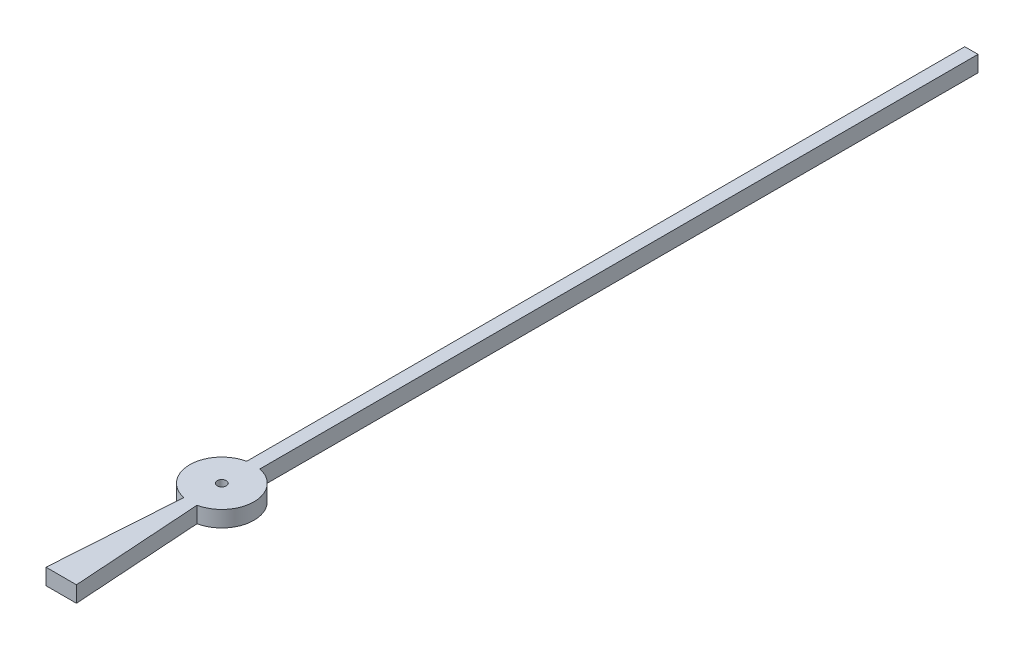
ISO-10303-21;
HEADER;
FILE_DESCRIPTION(('STEP AP214'),'2;1');
FILE_NAME('part.step','',(''),(''),'','','');
FILE_SCHEMA(('AUTOMOTIVE_DESIGN { 1 0 10303 214 1 1 1 1 }'));
ENDSEC;
DATA;
#1=APPLICATION_CONTEXT('core data for automotive mechanical design processes');
#2=APPLICATION_PROTOCOL_DEFINITION('international standard','automotive_design',2000,#1);
#3=PRODUCT_CONTEXT('',#1,'mechanical');
#4=PRODUCT('Part','Part','',(#3));
#5=PRODUCT_RELATED_PRODUCT_CATEGORY('part','',(#4));
#6=PRODUCT_DEFINITION_FORMATION('','',#4);
#7=PRODUCT_DEFINITION_CONTEXT('part definition',#1,'design');
#8=PRODUCT_DEFINITION('design','',#6,#7);
#9=PRODUCT_DEFINITION_SHAPE('','',#8);
#10=(LENGTH_UNIT() NAMED_UNIT(*) SI_UNIT(.MILLI.,.METRE.));
#11=(NAMED_UNIT(*) PLANE_ANGLE_UNIT() SI_UNIT($,.RADIAN.));
#12=(NAMED_UNIT(*) SI_UNIT($,.STERADIAN.) SOLID_ANGLE_UNIT());
#13=UNCERTAINTY_MEASURE_WITH_UNIT(LENGTH_MEASURE(1.E-05),#10,'distance_accuracy_value','');
#14=(GEOMETRIC_REPRESENTATION_CONTEXT(3) GLOBAL_UNCERTAINTY_ASSIGNED_CONTEXT((#13)) GLOBAL_UNIT_ASSIGNED_CONTEXT((#10,
#11,#12)) REPRESENTATION_CONTEXT('',''));
#15=CARTESIAN_POINT('',(0.,0.,0.));
#16=DIRECTION('',(0.,0.,1.));
#17=DIRECTION('',(1.,0.,0.));
#18=AXIS2_PLACEMENT_3D('',#15,#16,#17);
#19=CARTESIAN_POINT('',(0.,0.3,0.));
#20=DIRECTION('',(0.,-1.,0.));
#21=DIRECTION('',(0.,0.,-1.));
#22=AXIS2_PLACEMENT_3D('',#19,#20,#21);
#23=CYLINDRICAL_SURFACE('',#22,0.6);
#24=CARTESIAN_POINT('',(0.,0.,0.));
#25=DIRECTION('',(0.,1.,0.));
#26=DIRECTION('',(0.,0.,-1.));
#27=AXIS2_PLACEMENT_3D('',#24,#25,#26);
#28=CIRCLE('',#27,0.6);
#29=CARTESIAN_POINT('',(0.123615756232359,0.,0.587127877732868));
#30=VERTEX_POINT('',#29);
#31=CARTESIAN_POINT('',(0.123615756232359,0.,-0.587127877732868));
#32=VERTEX_POINT('',#31);
#33=EDGE_CURVE('E129',#30,#32,#28,.T.);
#34=ORIENTED_EDGE('',*,*,#33,.T.);
#35=DIRECTION('',(0.,-1.,0.));
#36=VECTOR('',#35,1.);
#37=CARTESIAN_POINT('',(0.123615756232359,0.3,-0.587127877732868));
#38=LINE('',#37,#36);
#39=CARTESIAN_POINT('',(0.123615756232359,0.3,-0.587127877732868));
#40=VERTEX_POINT('',#39);
#41=EDGE_CURVE('E11',#40,#32,#38,.T.);
#42=ORIENTED_EDGE('',*,*,#41,.F.);
#43=CARTESIAN_POINT('',(0.,0.3,0.));
#44=DIRECTION('',(0.,1.,0.));
#45=DIRECTION('',(0.,0.,-1.));
#46=AXIS2_PLACEMENT_3D('',#43,#44,#45);
#47=CIRCLE('',#46,0.6);
#48=CARTESIAN_POINT('',(0.123615756232359,0.3,0.587127877732868));
#49=VERTEX_POINT('',#48);
#50=EDGE_CURVE('E144',#49,#40,#47,.T.);
#51=ORIENTED_EDGE('',*,*,#50,.F.);
#52=DIRECTION('',(0.,-1.,0.));
#53=VECTOR('',#52,1.);
#54=CARTESIAN_POINT('',(0.123615756232359,0.3,0.587127877732868));
#55=LINE('',#54,#53);
#56=EDGE_CURVE('E125',#49,#30,#55,.T.);
#57=ORIENTED_EDGE('',*,*,#56,.T.);
#58=EDGE_LOOP('',(#34,#42,#51,#57));
#59=FACE_BOUND('',#58,.T.);
#60=ADVANCED_FACE('F33',(#59),#23,.T.);
#61=CARTESIAN_POINT('',(0.123615756232359,0.3,-14.));
#62=DIRECTION('',(-1.,0.,0.));
#63=DIRECTION('',(0.,0.,1.));
#64=AXIS2_PLACEMENT_3D('',#61,#62,#63);
#65=PLANE('',#64);
#66=DIRECTION('',(0.,0.,-1.));
#67=VECTOR('',#66,1.);
#68=CARTESIAN_POINT('',(0.123615756232359,0.,-14.));
#69=LINE('',#68,#67);
#70=CARTESIAN_POINT('',(0.123615756232359,0.,-14.));
#71=VERTEX_POINT('',#70);
#72=EDGE_CURVE('E132',#32,#71,#69,.T.);
#73=ORIENTED_EDGE('',*,*,#72,.T.);
#74=DIRECTION('',(0.,-1.,0.));
#75=VECTOR('',#74,1.);
#76=CARTESIAN_POINT('',(0.123615756232359,0.3,-14.));
#77=LINE('',#76,#75);
#78=CARTESIAN_POINT('',(0.123615756232359,0.3,-14.));
#79=VERTEX_POINT('',#78);
#80=EDGE_CURVE('E41',#79,#71,#77,.T.);
#81=ORIENTED_EDGE('',*,*,#80,.F.);
#82=DIRECTION('',(0.,0.,-1.));
#83=VECTOR('',#82,1.);
#84=CARTESIAN_POINT('',(0.123615756232359,0.3,-14.));
#85=LINE('',#84,#83);
#86=EDGE_CURVE('E92',#40,#79,#85,.T.);
#87=ORIENTED_EDGE('',*,*,#86,.F.);
#88=ORIENTED_EDGE('',*,*,#41,.T.);
#89=EDGE_LOOP('',(#73,#81,#87,#88));
#90=FACE_BOUND('',#89,.T.);
#91=ADVANCED_FACE('F200',(#90),#65,.F.);
#92=CARTESIAN_POINT('',(-0.123615756232363,0.3,-14.));
#93=DIRECTION('',(0.,0.,1.));
#94=DIRECTION('',(1.,0.,0.));
#95=AXIS2_PLACEMENT_3D('',#92,#93,#94);
#96=PLANE('',#95);
#97=DIRECTION('',(-1.,0.,0.));
#98=VECTOR('',#97,1.);
#99=CARTESIAN_POINT('',(-0.123615756232363,0.,-14.));
#100=LINE('',#99,#98);
#101=CARTESIAN_POINT('',(-0.123615756232363,0.,-14.));
#102=VERTEX_POINT('',#101);
#103=EDGE_CURVE('E135',#71,#102,#100,.T.);
#104=ORIENTED_EDGE('',*,*,#103,.T.);
#105=DIRECTION('',(0.,-1.,0.));
#106=VECTOR('',#105,1.);
#107=CARTESIAN_POINT('',(-0.123615756232363,0.3,-14.));
#108=LINE('',#107,#106);
#109=CARTESIAN_POINT('',(-0.123615756232363,0.3,-14.));
#110=VERTEX_POINT('',#109);
#111=EDGE_CURVE('E151',#110,#102,#108,.T.);
#112=ORIENTED_EDGE('',*,*,#111,.F.);
#113=DIRECTION('',(-1.,0.,0.));
#114=VECTOR('',#113,1.);
#115=CARTESIAN_POINT('',(-0.123615756232363,0.3,-14.));
#116=LINE('',#115,#114);
#117=EDGE_CURVE('E159',#79,#110,#116,.T.);
#118=ORIENTED_EDGE('',*,*,#117,.F.);
#119=ORIENTED_EDGE('',*,*,#80,.T.);
#120=EDGE_LOOP('',(#104,#112,#118,#119));
#121=FACE_BOUND('',#120,.T.);
#122=ADVANCED_FACE('F157',(#121),#96,.F.);
#123=CARTESIAN_POINT('',(-0.123615756232363,0.3,-14.));
#124=DIRECTION('',(1.,0.,0.));
#125=DIRECTION('',(0.,0.,-1.));
#126=AXIS2_PLACEMENT_3D('',#123,#124,#125);
#127=PLANE('',#126);
#128=DIRECTION('',(0.,0.,1.));
#129=VECTOR('',#128,1.);
#130=CARTESIAN_POINT('',(-0.123615756232363,0.,-14.));
#131=LINE('',#130,#129);
#132=CARTESIAN_POINT('',(-0.123615756232359,0.,-0.587127877732868));
#133=VERTEX_POINT('',#132);
#134=EDGE_CURVE('E137',#102,#133,#131,.T.);
#135=ORIENTED_EDGE('',*,*,#134,.T.);
#136=DIRECTION('',(0.,-1.,0.));
#137=VECTOR('',#136,1.);
#138=CARTESIAN_POINT('',(-0.123615756232359,0.3,-0.587127877732868));
#139=LINE('',#138,#137);
#140=CARTESIAN_POINT('',(-0.123615756232359,0.3,-0.587127877732868));
#141=VERTEX_POINT('',#140);
#142=EDGE_CURVE('E148',#141,#133,#139,.T.);
#143=ORIENTED_EDGE('',*,*,#142,.F.);
#144=DIRECTION('',(0.,0.,1.));
#145=VECTOR('',#144,1.);
#146=CARTESIAN_POINT('',(-0.123615756232363,0.3,-14.));
#147=LINE('',#146,#145);
#148=EDGE_CURVE('E171',#110,#141,#147,.T.);
#149=ORIENTED_EDGE('',*,*,#148,.F.);
#150=ORIENTED_EDGE('',*,*,#111,.T.);
#151=EDGE_LOOP('',(#135,#143,#149,#150));
#152=FACE_BOUND('',#151,.T.);
#153=ADVANCED_FACE('F167',(#152),#127,.F.);
#154=CARTESIAN_POINT('',(0.,0.3,0.));
#155=DIRECTION('',(0.,-1.,0.));
#156=DIRECTION('',(0.,0.,-1.));
#157=AXIS2_PLACEMENT_3D('',#154,#155,#156);
#158=CYLINDRICAL_SURFACE('',#157,0.6);
#159=CARTESIAN_POINT('',(0.,0.,0.));
#160=DIRECTION('',(0.,1.,0.));
#161=DIRECTION('',(0.,0.,1.));
#162=AXIS2_PLACEMENT_3D('',#159,#160,#161);
#163=CIRCLE('',#162,0.6);
#164=CARTESIAN_POINT('',(-0.123615756232359,0.,0.587127877732868));
#165=VERTEX_POINT('',#164);
#166=EDGE_CURVE('E139',#133,#165,#163,.T.);
#167=ORIENTED_EDGE('',*,*,#166,.T.);
#168=DIRECTION('',(0.,-1.,0.));
#169=VECTOR('',#168,1.);
#170=CARTESIAN_POINT('',(-0.123615756232359,0.3,0.587127877732868));
#171=LINE('',#170,#169);
#172=CARTESIAN_POINT('',(-0.123615756232359,0.3,0.587127877732868));
#173=VERTEX_POINT('',#172);
#174=EDGE_CURVE('E120',#173,#165,#171,.T.);
#175=ORIENTED_EDGE('',*,*,#174,.F.);
#176=CARTESIAN_POINT('',(0.,0.3,0.));
#177=DIRECTION('',(0.,1.,0.));
#178=DIRECTION('',(0.,0.,1.));
#179=AXIS2_PLACEMENT_3D('',#176,#177,#178);
#180=CIRCLE('',#179,0.6);
#181=EDGE_CURVE('E111',#141,#173,#180,.T.);
#182=ORIENTED_EDGE('',*,*,#181,.F.);
#183=ORIENTED_EDGE('',*,*,#142,.T.);
#184=EDGE_LOOP('',(#167,#175,#182,#183));
#185=FACE_BOUND('',#184,.T.);
#186=ADVANCED_FACE('F170',(#185),#158,.T.);
#187=CARTESIAN_POINT('',(-0.123615756232359,0.3,0.587127877732868));
#188=DIRECTION('',(0.997790797030966,0.,0.0664343688184843));
#189=DIRECTION('',(0.0664343688184843,0.,-0.997790797030966));
#190=AXIS2_PLACEMENT_3D('',#187,#188,#189);
#191=PLANE('',#190);
#192=DIRECTION('',(-0.0664343688184843,0.,0.997790797030966));
#193=VECTOR('',#192,1.);
#194=CARTESIAN_POINT('',(-0.123615756232359,0.,0.587127877732868));
#195=LINE('',#194,#193);
#196=CARTESIAN_POINT('',(-0.284268306806604,0.,3.));
#197=VERTEX_POINT('',#196);
#198=EDGE_CURVE('E119',#165,#197,#195,.T.);
#199=ORIENTED_EDGE('',*,*,#198,.T.);
#200=DIRECTION('',(0.,-1.,0.));
#201=VECTOR('',#200,1.);
#202=CARTESIAN_POINT('',(-0.284268306806604,0.3,3.));
#203=LINE('',#202,#201);
#204=CARTESIAN_POINT('',(-0.284268306806604,0.3,3.));
#205=VERTEX_POINT('',#204);
#206=EDGE_CURVE('E116',#205,#197,#203,.T.);
#207=ORIENTED_EDGE('',*,*,#206,.F.);
#208=DIRECTION('',(-0.0664343688184843,0.,0.997790797030966));
#209=VECTOR('',#208,1.);
#210=CARTESIAN_POINT('',(-0.123615756232359,0.3,0.587127877732868));
#211=LINE('',#210,#209);
#212=EDGE_CURVE('E105',#173,#205,#211,.T.);
#213=ORIENTED_EDGE('',*,*,#212,.F.);
#214=ORIENTED_EDGE('',*,*,#174,.T.);
#215=EDGE_LOOP('',(#199,#207,#213,#214));
#216=FACE_BOUND('',#215,.T.);
#217=ADVANCED_FACE('F117',(#216),#191,.F.);
#218=CARTESIAN_POINT('',(0.284268306806605,0.3,3.));
#219=DIRECTION('',(0.,0.,-1.));
#220=DIRECTION('',(-1.,0.,0.));
#221=AXIS2_PLACEMENT_3D('',#218,#219,#220);
#222=PLANE('',#221);
#223=DIRECTION('',(1.,0.,0.));
#224=VECTOR('',#223,1.);
#225=CARTESIAN_POINT('',(0.284268306806605,0.,3.));
#226=LINE('',#225,#224);
#227=CARTESIAN_POINT('',(0.284268306806605,0.,3.));
#228=VERTEX_POINT('',#227);
#229=EDGE_CURVE('E78',#197,#228,#226,.T.);
#230=ORIENTED_EDGE('',*,*,#229,.T.);
#231=DIRECTION('',(0.,-1.,0.));
#232=VECTOR('',#231,1.);
#233=CARTESIAN_POINT('',(0.284268306806605,0.3,3.));
#234=LINE('',#233,#232);
#235=CARTESIAN_POINT('',(0.284268306806605,0.3,3.));
#236=VERTEX_POINT('',#235);
#237=EDGE_CURVE('E121',#236,#228,#234,.T.);
#238=ORIENTED_EDGE('',*,*,#237,.F.);
#239=DIRECTION('',(1.,0.,0.));
#240=VECTOR('',#239,1.);
#241=CARTESIAN_POINT('',(0.284268306806605,0.3,3.));
#242=LINE('',#241,#240);
#243=EDGE_CURVE('E109',#205,#236,#242,.T.);
#244=ORIENTED_EDGE('',*,*,#243,.F.);
#245=ORIENTED_EDGE('',*,*,#206,.T.);
#246=EDGE_LOOP('',(#230,#238,#244,#245));
#247=FACE_BOUND('',#246,.T.);
#248=ADVANCED_FACE('F123',(#247),#222,.F.);
#249=CARTESIAN_POINT('',(0.123615756232359,0.3,0.587127877732868));
#250=DIRECTION('',(-0.997790797030966,0.,0.0664343688184846));
#251=DIRECTION('',(0.0664343688184846,0.,0.997790797030966));
#252=AXIS2_PLACEMENT_3D('',#249,#250,#251);
#253=PLANE('',#252);
#254=DIRECTION('',(-0.0664343688184846,0.,-0.997790797030966));
#255=VECTOR('',#254,1.);
#256=CARTESIAN_POINT('',(0.123615756232359,0.,0.587127877732868));
#257=LINE('',#256,#255);
#258=EDGE_CURVE('E84',#228,#30,#257,.T.);
#259=ORIENTED_EDGE('',*,*,#258,.T.);
#260=ORIENTED_EDGE('',*,*,#56,.F.);
#261=DIRECTION('',(-0.0664343688184846,0.,-0.997790797030966));
#262=VECTOR('',#261,1.);
#263=CARTESIAN_POINT('',(0.123615756232359,0.3,0.587127877732868));
#264=LINE('',#263,#262);
#265=EDGE_CURVE('E49',#236,#49,#264,.T.);
#266=ORIENTED_EDGE('',*,*,#265,.F.);
#267=ORIENTED_EDGE('',*,*,#237,.T.);
#268=EDGE_LOOP('',(#259,#260,#266,#267));
#269=FACE_BOUND('',#268,.T.);
#270=ADVANCED_FACE('F191',(#269),#253,.F.);
#271=CARTESIAN_POINT('',(0.,0.3,0.));
#272=DIRECTION('',(0.,-1.,0.));
#273=DIRECTION('',(0.,0.,-1.));
#274=AXIS2_PLACEMENT_3D('',#271,#272,#273);
#275=PLANE('',#274);
#276=CARTESIAN_POINT('',(0.,0.3,0.));
#277=DIRECTION('',(0.,1.,0.));
#278=DIRECTION('',(0.,0.,1.));
#279=AXIS2_PLACEMENT_3D('',#276,#277,#278);
#280=CIRCLE('',#279,0.085);
#281=CARTESIAN_POINT('',(0.,0.3,0.085));
#282=VERTEX_POINT('',#281);
#283=EDGE_CURVE('E177',#282,#282,#280,.T.);
#284=ORIENTED_EDGE('',*,*,#283,.F.);
#285=EDGE_LOOP('',(#284));
#286=FACE_BOUND('',#285,.T.);
#287=ORIENTED_EDGE('',*,*,#50,.T.);
#288=ORIENTED_EDGE('',*,*,#86,.T.);
#289=ORIENTED_EDGE('',*,*,#117,.T.);
#290=ORIENTED_EDGE('',*,*,#148,.T.);
#291=ORIENTED_EDGE('',*,*,#181,.T.);
#292=ORIENTED_EDGE('',*,*,#212,.T.);
#293=ORIENTED_EDGE('',*,*,#243,.T.);
#294=ORIENTED_EDGE('',*,*,#265,.T.);
#295=EDGE_LOOP('',(#287,#288,#289,#290,#291,#292,#293,#294));
#296=FACE_BOUND('',#295,.T.);
#297=ADVANCED_FACE('F107',(#286,#296),#275,.F.);
#298=CARTESIAN_POINT('',(0.,0.,0.));
#299=DIRECTION('',(0.,-1.,0.));
#300=DIRECTION('',(0.,0.,-1.));
#301=AXIS2_PLACEMENT_3D('',#298,#299,#300);
#302=PLANE('',#301);
#303=CARTESIAN_POINT('',(0.,0.,0.));
#304=DIRECTION('',(0.,1.,0.));
#305=DIRECTION('',(0.,0.,1.));
#306=AXIS2_PLACEMENT_3D('',#303,#304,#305);
#307=CIRCLE('',#306,0.085);
#308=CARTESIAN_POINT('',(0.,0.,0.085));
#309=VERTEX_POINT('',#308);
#310=EDGE_CURVE('E133',#309,#309,#307,.T.);
#311=ORIENTED_EDGE('',*,*,#310,.T.);
#312=EDGE_LOOP('',(#311));
#313=FACE_BOUND('',#312,.T.);
#314=ORIENTED_EDGE('',*,*,#33,.F.);
#315=ORIENTED_EDGE('',*,*,#258,.F.);
#316=ORIENTED_EDGE('',*,*,#229,.F.);
#317=ORIENTED_EDGE('',*,*,#198,.F.);
#318=ORIENTED_EDGE('',*,*,#166,.F.);
#319=ORIENTED_EDGE('',*,*,#134,.F.);
#320=ORIENTED_EDGE('',*,*,#103,.F.);
#321=ORIENTED_EDGE('',*,*,#72,.F.);
#322=EDGE_LOOP('',(#314,#315,#316,#317,#318,#319,#320,#321));
#323=FACE_BOUND('',#322,.T.);
#324=ADVANCED_FACE('F163',(#313,#323),#302,.T.);
#325=CARTESIAN_POINT('',(0.,0.,0.));
#326=DIRECTION('',(0.,1.,0.));
#327=DIRECTION('',(0.,0.,1.));
#328=AXIS2_PLACEMENT_3D('',#325,#326,#327);
#329=CYLINDRICAL_SURFACE('',#328,0.085);
#330=ORIENTED_EDGE('',*,*,#310,.F.);
#331=EDGE_LOOP('',(#330));
#332=FACE_BOUND('',#331,.T.);
#333=ORIENTED_EDGE('',*,*,#283,.T.);
#334=EDGE_LOOP('',(#333));
#335=FACE_BOUND('',#334,.T.);
#336=ADVANCED_FACE('F184',(#332,#335),#329,.F.);
#337=CLOSED_SHELL('',(#60,#91,#122,#153,#186,#217,#248,#270,#297,#324,#336));
#338=MANIFOLD_SOLID_BREP('B2',#337);
#339=ADVANCED_BREP_SHAPE_REPRESENTATION('',(#18,#338),#14);
#340=SHAPE_DEFINITION_REPRESENTATION(#9,#339);
ENDSEC;
END-ISO-10303-21;
